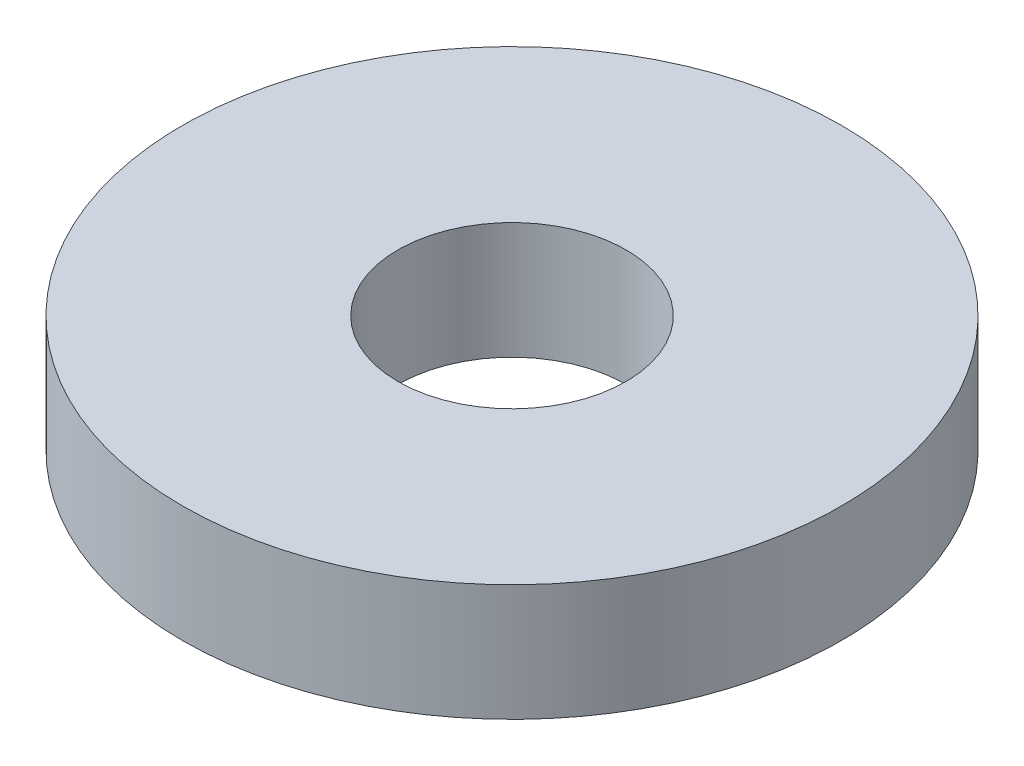
ISO-10303-21;
HEADER;
FILE_DESCRIPTION(('STEP AP214'),'2;1');
FILE_NAME('part.step','',(''),(''),'','','');
FILE_SCHEMA(('AUTOMOTIVE_DESIGN { 1 0 10303 214 1 1 1 1 }'));
ENDSEC;
DATA;
#1=APPLICATION_CONTEXT('core data for automotive mechanical design processes');
#2=APPLICATION_PROTOCOL_DEFINITION('international standard','automotive_design',2000,#1);
#3=PRODUCT_CONTEXT('',#1,'mechanical');
#4=PRODUCT('Part','Part','',(#3));
#5=PRODUCT_RELATED_PRODUCT_CATEGORY('part','',(#4));
#6=PRODUCT_DEFINITION_FORMATION('','',#4);
#7=PRODUCT_DEFINITION_CONTEXT('part definition',#1,'design');
#8=PRODUCT_DEFINITION('design','',#6,#7);
#9=PRODUCT_DEFINITION_SHAPE('','',#8);
#10=(LENGTH_UNIT() NAMED_UNIT(*) SI_UNIT(.MILLI.,.METRE.));
#11=(NAMED_UNIT(*) PLANE_ANGLE_UNIT() SI_UNIT($,.RADIAN.));
#12=(NAMED_UNIT(*) SI_UNIT($,.STERADIAN.) SOLID_ANGLE_UNIT());
#13=UNCERTAINTY_MEASURE_WITH_UNIT(LENGTH_MEASURE(1.E-05),#10,'distance_accuracy_value','');
#14=(GEOMETRIC_REPRESENTATION_CONTEXT(3) GLOBAL_UNCERTAINTY_ASSIGNED_CONTEXT((#13)) GLOBAL_UNIT_ASSIGNED_CONTEXT((#10,
#11,#12)) REPRESENTATION_CONTEXT('',''));
#15=CARTESIAN_POINT('',(0.,0.,0.));
#16=DIRECTION('',(0.,0.,1.));
#17=DIRECTION('',(1.,0.,0.));
#18=AXIS2_PLACEMENT_3D('',#15,#16,#17);
#19=CARTESIAN_POINT('',(0.,23.,0.));
#20=DIRECTION('',(0.,-1.,0.));
#21=DIRECTION('',(0.,0.,-1.));
#22=AXIS2_PLACEMENT_3D('',#19,#20,#21);
#23=CYLINDRICAL_SURFACE('',#22,65.);
#24=CARTESIAN_POINT('',(0.,23.,0.));
#25=DIRECTION('',(0.,1.,0.));
#26=DIRECTION('',(0.,0.,1.));
#27=AXIS2_PLACEMENT_3D('',#24,#25,#26);
#28=CIRCLE('',#27,65.);
#29=CARTESIAN_POINT('',(0.,23.,65.));
#30=VERTEX_POINT('',#29);
#31=EDGE_CURVE('E10',#30,#30,#28,.T.);
#32=ORIENTED_EDGE('',*,*,#31,.F.);
#33=EDGE_LOOP('',(#32));
#34=FACE_BOUND('',#33,.T.);
#35=CARTESIAN_POINT('',(0.,0.,0.));
#36=DIRECTION('',(0.,1.,0.));
#37=DIRECTION('',(0.,0.,1.));
#38=AXIS2_PLACEMENT_3D('',#35,#36,#37);
#39=CIRCLE('',#38,65.);
#40=CARTESIAN_POINT('',(0.,0.,65.));
#41=VERTEX_POINT('',#40);
#42=EDGE_CURVE('E37',#41,#41,#39,.T.);
#43=ORIENTED_EDGE('',*,*,#42,.T.);
#44=EDGE_LOOP('',(#43));
#45=FACE_BOUND('',#44,.T.);
#46=ADVANCED_FACE('F40',(#34,#45),#23,.T.);
#47=CARTESIAN_POINT('',(0.,23.,0.));
#48=DIRECTION('',(0.,1.,0.));
#49=DIRECTION('',(0.,0.,1.));
#50=AXIS2_PLACEMENT_3D('',#47,#48,#49);
#51=PLANE('',#50);
#52=CARTESIAN_POINT('',(0.,23.,0.));
#53=DIRECTION('',(0.,1.,0.));
#54=DIRECTION('',(0.,0.,1.));
#55=AXIS2_PLACEMENT_3D('',#52,#53,#54);
#56=CIRCLE('',#55,22.5);
#57=CARTESIAN_POINT('',(0.,23.,22.5));
#58=VERTEX_POINT('',#57);
#59=EDGE_CURVE('E50',#58,#58,#56,.T.);
#60=ORIENTED_EDGE('',*,*,#59,.F.);
#61=EDGE_LOOP('',(#60));
#62=FACE_BOUND('',#61,.T.);
#63=ORIENTED_EDGE('',*,*,#31,.T.);
#64=EDGE_LOOP('',(#63));
#65=FACE_BOUND('',#64,.T.);
#66=ADVANCED_FACE('F59',(#62,#65),#51,.T.);
#67=CARTESIAN_POINT('',(0.,0.,0.));
#68=DIRECTION('',(0.,1.,0.));
#69=DIRECTION('',(0.,0.,1.));
#70=AXIS2_PLACEMENT_3D('',#67,#68,#69);
#71=PLANE('',#70);
#72=CARTESIAN_POINT('',(0.,0.,0.));
#73=DIRECTION('',(0.,1.,0.));
#74=DIRECTION('',(0.,0.,1.));
#75=AXIS2_PLACEMENT_3D('',#72,#73,#74);
#76=CIRCLE('',#75,22.5);
#77=CARTESIAN_POINT('',(0.,0.,22.5));
#78=VERTEX_POINT('',#77);
#79=EDGE_CURVE('E47',#78,#78,#76,.T.);
#80=ORIENTED_EDGE('',*,*,#79,.T.);
#81=EDGE_LOOP('',(#80));
#82=FACE_BOUND('',#81,.T.);
#83=ORIENTED_EDGE('',*,*,#42,.F.);
#84=EDGE_LOOP('',(#83));
#85=FACE_BOUND('',#84,.T.);
#86=ADVANCED_FACE('F58',(#82,#85),#71,.F.);
#87=CARTESIAN_POINT('',(0.,23.,0.));
#88=DIRECTION('',(0.,-1.,0.));
#89=DIRECTION('',(0.,0.,-1.));
#90=AXIS2_PLACEMENT_3D('',#87,#88,#89);
#91=CYLINDRICAL_SURFACE('',#90,22.5);
#92=ORIENTED_EDGE('',*,*,#59,.T.);
#93=EDGE_LOOP('',(#92));
#94=FACE_BOUND('',#93,.T.);
#95=ORIENTED_EDGE('',*,*,#79,.F.);
#96=EDGE_LOOP('',(#95));
#97=FACE_BOUND('',#96,.T.);
#98=ADVANCED_FACE('F54',(#94,#97),#91,.F.);
#99=CLOSED_SHELL('',(#46,#66,#86,#98));
#100=MANIFOLD_SOLID_BREP('B2',#99);
#101=ADVANCED_BREP_SHAPE_REPRESENTATION('',(#18,#100),#14);
#102=SHAPE_DEFINITION_REPRESENTATION(#9,#101);
ENDSEC;
END-ISO-10303-21;
